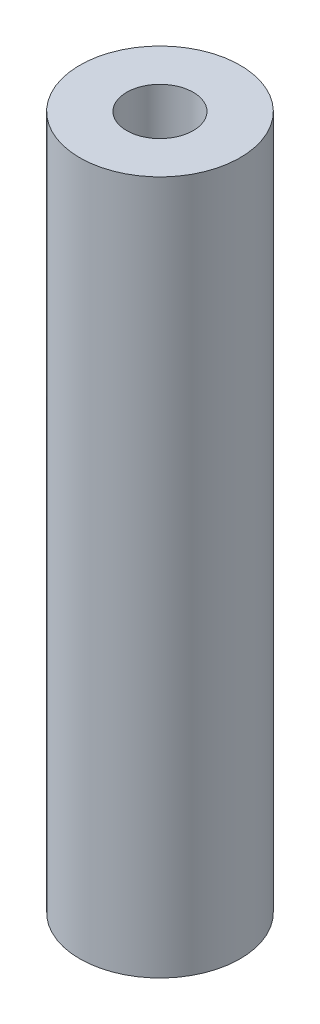
ISO-10303-21;
HEADER;
FILE_DESCRIPTION(('STEP AP214'),'2;1');
FILE_NAME('part.step','',(''),(''),'','','');
FILE_SCHEMA(('AUTOMOTIVE_DESIGN { 1 0 10303 214 1 1 1 1 }'));
ENDSEC;
DATA;
#1=APPLICATION_CONTEXT('core data for automotive mechanical design processes');
#2=APPLICATION_PROTOCOL_DEFINITION('international standard','automotive_design',2000,#1);
#3=PRODUCT_CONTEXT('',#1,'mechanical');
#4=PRODUCT('Part','Part','',(#3));
#5=PRODUCT_RELATED_PRODUCT_CATEGORY('part','',(#4));
#6=PRODUCT_DEFINITION_FORMATION('','',#4);
#7=PRODUCT_DEFINITION_CONTEXT('part definition',#1,'design');
#8=PRODUCT_DEFINITION('design','',#6,#7);
#9=PRODUCT_DEFINITION_SHAPE('','',#8);
#10=(LENGTH_UNIT() NAMED_UNIT(*) SI_UNIT(.MILLI.,.METRE.));
#11=(NAMED_UNIT(*) PLANE_ANGLE_UNIT() SI_UNIT($,.RADIAN.));
#12=(NAMED_UNIT(*) SI_UNIT($,.STERADIAN.) SOLID_ANGLE_UNIT());
#13=UNCERTAINTY_MEASURE_WITH_UNIT(LENGTH_MEASURE(1.E-05),#10,'distance_accuracy_value','');
#14=(GEOMETRIC_REPRESENTATION_CONTEXT(3) GLOBAL_UNCERTAINTY_ASSIGNED_CONTEXT((#13)) GLOBAL_UNIT_ASSIGNED_CONTEXT((#10,
#11,#12)) REPRESENTATION_CONTEXT('',''));
#15=CARTESIAN_POINT('',(0.,0.,0.));
#16=DIRECTION('',(0.,0.,1.));
#17=DIRECTION('',(1.,0.,0.));
#18=AXIS2_PLACEMENT_3D('',#15,#16,#17);
#19=CARTESIAN_POINT('',(0.,17.2,0.));
#20=DIRECTION('',(0.,-1.,0.));
#21=DIRECTION('',(0.,0.,-1.));
#22=AXIS2_PLACEMENT_3D('',#19,#20,#21);
#23=CYLINDRICAL_SURFACE('',#22,3.9751);
#24=CARTESIAN_POINT('',(0.,17.2,0.));
#25=DIRECTION('',(0.,1.,0.));
#26=DIRECTION('',(0.,0.,1.));
#27=AXIS2_PLACEMENT_3D('',#24,#25,#26);
#28=CIRCLE('',#27,3.9751);
#29=CARTESIAN_POINT('',(0.,17.2,3.9751));
#30=VERTEX_POINT('',#29);
#31=EDGE_CURVE('E11',#30,#30,#28,.T.);
#32=ORIENTED_EDGE('',*,*,#31,.F.);
#33=EDGE_LOOP('',(#32));
#34=FACE_BOUND('',#33,.T.);
#35=CARTESIAN_POINT('',(0.,-17.2,0.));
#36=DIRECTION('',(0.,1.,0.));
#37=DIRECTION('',(0.,0.,1.));
#38=AXIS2_PLACEMENT_3D('',#35,#36,#37);
#39=CIRCLE('',#38,3.9751);
#40=CARTESIAN_POINT('',(0.,-17.2,3.9751));
#41=VERTEX_POINT('',#40);
#42=EDGE_CURVE('E44',#41,#41,#39,.T.);
#43=ORIENTED_EDGE('',*,*,#42,.T.);
#44=EDGE_LOOP('',(#43));
#45=FACE_BOUND('',#44,.T.);
#46=ADVANCED_FACE('F41',(#34,#45),#23,.T.);
#47=CARTESIAN_POINT('',(0.,17.2,0.));
#48=DIRECTION('',(0.,1.,0.));
#49=DIRECTION('',(0.,0.,1.));
#50=AXIS2_PLACEMENT_3D('',#47,#48,#49);
#51=PLANE('',#50);
#52=CARTESIAN_POINT('',(0.,17.2,0.));
#53=DIRECTION('',(0.,1.,0.));
#54=DIRECTION('',(0.,0.,1.));
#55=AXIS2_PLACEMENT_3D('',#52,#53,#54);
#56=CIRCLE('',#55,1.65);
#57=CARTESIAN_POINT('',(0.,17.2,1.65));
#58=VERTEX_POINT('',#57);
#59=EDGE_CURVE('E64',#58,#58,#56,.T.);
#60=ORIENTED_EDGE('',*,*,#59,.F.);
#61=EDGE_LOOP('',(#60));
#62=FACE_BOUND('',#61,.T.);
#63=ORIENTED_EDGE('',*,*,#31,.T.);
#64=EDGE_LOOP('',(#63));
#65=FACE_BOUND('',#64,.T.);
#66=ADVANCED_FACE('F83',(#62,#65),#51,.T.);
#67=CARTESIAN_POINT('',(0.,-17.2,0.));
#68=DIRECTION('',(0.,1.,0.));
#69=DIRECTION('',(0.,0.,1.));
#70=AXIS2_PLACEMENT_3D('',#67,#68,#69);
#71=PLANE('',#70);
#72=CARTESIAN_POINT('',(0.,-17.2,0.));
#73=DIRECTION('',(0.,-1.,0.));
#74=DIRECTION('',(0.,0.,-1.));
#75=AXIS2_PLACEMENT_3D('',#72,#73,#74);
#76=CIRCLE('',#75,1.64999999999999);
#77=CARTESIAN_POINT('',(0.,-17.2,-1.64999999999999));
#78=VERTEX_POINT('',#77);
#79=EDGE_CURVE('E65',#78,#78,#76,.T.);
#80=ORIENTED_EDGE('',*,*,#79,.F.);
#81=EDGE_LOOP('',(#80));
#82=FACE_BOUND('',#81,.T.);
#83=ORIENTED_EDGE('',*,*,#42,.F.);
#84=EDGE_LOOP('',(#83));
#85=FACE_BOUND('',#84,.T.);
#86=ADVANCED_FACE('F80',(#82,#85),#71,.F.);
#87=CARTESIAN_POINT('',(0.,7.2,0.));
#88=DIRECTION('',(0.,1.,0.));
#89=DIRECTION('',(0.,0.,1.));
#90=AXIS2_PLACEMENT_3D('',#87,#88,#89);
#91=CONICAL_SURFACE('',#90,1.65,1.02974425867665);
#92=CARTESIAN_POINT('',(0.,6.20857997860452,0.));
#93=VERTEX_POINT('',#92);
#94=VERTEX_LOOP('',#93);
#95=FACE_BOUND('',#94,.T.);
#96=CARTESIAN_POINT('',(0.,7.2,0.));
#97=DIRECTION('',(0.,1.,0.));
#98=DIRECTION('',(0.,0.,1.));
#99=AXIS2_PLACEMENT_3D('',#96,#97,#98);
#100=CIRCLE('',#99,1.65);
#101=CARTESIAN_POINT('',(0.,7.2,1.65));
#102=VERTEX_POINT('',#101);
#103=EDGE_CURVE('E68',#102,#102,#100,.T.);
#104=ORIENTED_EDGE('',*,*,#103,.T.);
#105=EDGE_LOOP('',(#104));
#106=FACE_BOUND('',#105,.T.);
#107=ADVANCED_FACE('F82',(#95,#106),#91,.F.);
#108=CARTESIAN_POINT('',(0.,17.2,0.));
#109=DIRECTION('',(0.,1.,0.));
#110=DIRECTION('',(0.,0.,1.));
#111=AXIS2_PLACEMENT_3D('',#108,#109,#110);
#112=CYLINDRICAL_SURFACE('',#111,1.65);
#113=ORIENTED_EDGE('',*,*,#103,.F.);
#114=EDGE_LOOP('',(#113));
#115=FACE_BOUND('',#114,.T.);
#116=ORIENTED_EDGE('',*,*,#59,.T.);
#117=EDGE_LOOP('',(#116));
#118=FACE_BOUND('',#117,.T.);
#119=ADVANCED_FACE('F58',(#115,#118),#112,.F.);
#120=CARTESIAN_POINT('',(0.,-7.2,0.));
#121=DIRECTION('',(0.,-1.,0.));
#122=DIRECTION('',(0.,0.,-1.));
#123=AXIS2_PLACEMENT_3D('',#120,#121,#122);
#124=CONICAL_SURFACE('',#123,1.65,1.02974425867665);
#125=CARTESIAN_POINT('',(0.,-6.20857997860452,0.));
#126=VERTEX_POINT('',#125);
#127=VERTEX_LOOP('',#126);
#128=FACE_BOUND('',#127,.T.);
#129=CARTESIAN_POINT('',(0.,-7.2,0.));
#130=DIRECTION('',(0.,-1.,0.));
#131=DIRECTION('',(0.,0.,-1.));
#132=AXIS2_PLACEMENT_3D('',#129,#130,#131);
#133=CIRCLE('',#132,1.65);
#134=CARTESIAN_POINT('',(0.,-7.2,-1.65));
#135=VERTEX_POINT('',#134);
#136=EDGE_CURVE('E62',#135,#135,#133,.T.);
#137=ORIENTED_EDGE('',*,*,#136,.T.);
#138=EDGE_LOOP('',(#137));
#139=FACE_BOUND('',#138,.T.);
#140=ADVANCED_FACE('F54',(#128,#139),#124,.F.);
#141=CARTESIAN_POINT('',(0.,-17.2,0.));
#142=DIRECTION('',(0.,-1.,0.));
#143=DIRECTION('',(0.,0.,-1.));
#144=AXIS2_PLACEMENT_3D('',#141,#142,#143);
#145=CYLINDRICAL_SURFACE('',#144,1.64999999999999);
#146=ORIENTED_EDGE('',*,*,#136,.F.);
#147=EDGE_LOOP('',(#146));
#148=FACE_BOUND('',#147,.T.);
#149=ORIENTED_EDGE('',*,*,#79,.T.);
#150=EDGE_LOOP('',(#149));
#151=FACE_BOUND('',#150,.T.);
#152=ADVANCED_FACE('F57',(#148,#151),#145,.F.);
#153=CLOSED_SHELL('',(#46,#66,#86,#107,#119,#140,#152));
#154=MANIFOLD_SOLID_BREP('B2',#153);
#155=ADVANCED_BREP_SHAPE_REPRESENTATION('',(#18,#154),#14);
#156=SHAPE_DEFINITION_REPRESENTATION(#9,#155);
ENDSEC;
END-ISO-10303-21;
